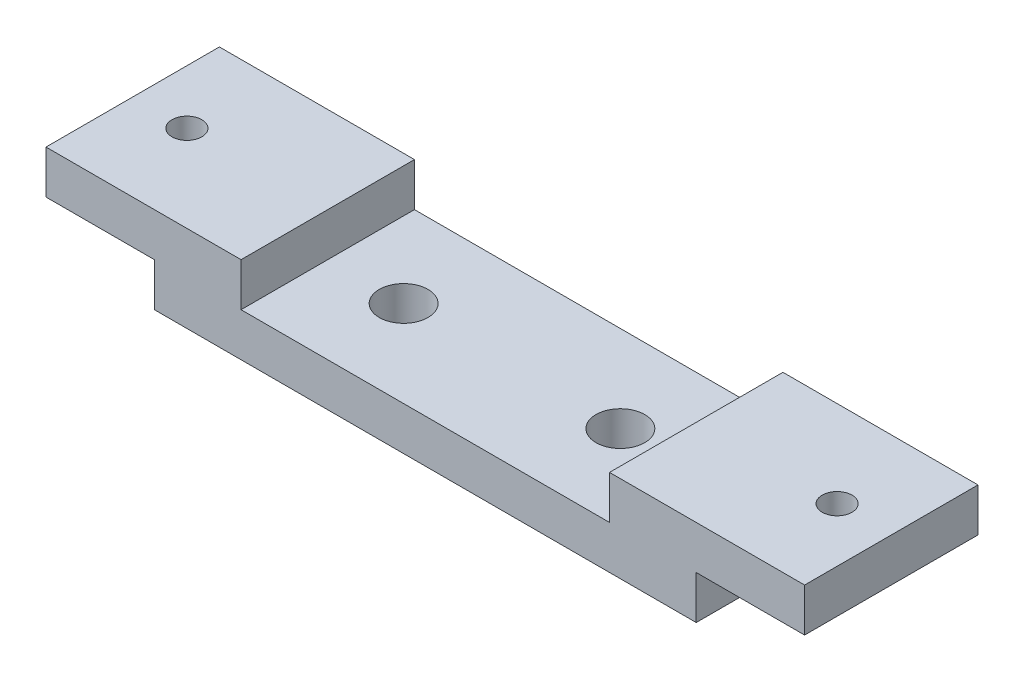
ISO-10303-21;
HEADER;
FILE_DESCRIPTION(('STEP AP214'),'2;1');
FILE_NAME('part.step','',(''),(''),'','','');
FILE_SCHEMA(('AUTOMOTIVE_DESIGN { 1 0 10303 214 1 1 1 1 }'));
ENDSEC;
DATA;
#1=APPLICATION_CONTEXT('core data for automotive mechanical design processes');
#2=APPLICATION_PROTOCOL_DEFINITION('international standard','automotive_design',2000,#1);
#3=PRODUCT_CONTEXT('',#1,'mechanical');
#4=PRODUCT('Part','Part','',(#3));
#5=PRODUCT_RELATED_PRODUCT_CATEGORY('part','',(#4));
#6=PRODUCT_DEFINITION_FORMATION('','',#4);
#7=PRODUCT_DEFINITION_CONTEXT('part definition',#1,'design');
#8=PRODUCT_DEFINITION('design','',#6,#7);
#9=PRODUCT_DEFINITION_SHAPE('','',#8);
#10=(LENGTH_UNIT() NAMED_UNIT(*) SI_UNIT(.MILLI.,.METRE.));
#11=(NAMED_UNIT(*) PLANE_ANGLE_UNIT() SI_UNIT($,.RADIAN.));
#12=(NAMED_UNIT(*) SI_UNIT($,.STERADIAN.) SOLID_ANGLE_UNIT());
#13=UNCERTAINTY_MEASURE_WITH_UNIT(LENGTH_MEASURE(1.E-05),#10,'distance_accuracy_value','');
#14=(GEOMETRIC_REPRESENTATION_CONTEXT(3) GLOBAL_UNCERTAINTY_ASSIGNED_CONTEXT((#13)) GLOBAL_UNIT_ASSIGNED_CONTEXT((#10,
#11,#12)) REPRESENTATION_CONTEXT('',''));
#15=CARTESIAN_POINT('',(0.,0.,0.));
#16=DIRECTION('',(0.,0.,1.));
#17=DIRECTION('',(1.,0.,0.));
#18=AXIS2_PLACEMENT_3D('',#15,#16,#17);
#19=CARTESIAN_POINT('',(-70.,8.,32.));
#20=DIRECTION('',(1.,0.,0.));
#21=DIRECTION('',(0.,0.,-1.));
#22=AXIS2_PLACEMENT_3D('',#19,#20,#21);
#23=PLANE('',#22);
#24=DIRECTION('',(0.,-1.,0.));
#25=VECTOR('',#24,1.);
#26=CARTESIAN_POINT('',(-70.,8.,0.));
#27=LINE('',#26,#25);
#28=CARTESIAN_POINT('',(-70.,16.,0.));
#29=VERTEX_POINT('',#28);
#30=CARTESIAN_POINT('',(-70.,8.,0.));
#31=VERTEX_POINT('',#30);
#32=EDGE_CURVE('E164',#29,#31,#27,.T.);
#33=ORIENTED_EDGE('',*,*,#32,.T.);
#34=DIRECTION('',(0.,0.,-1.));
#35=VECTOR('',#34,1.);
#36=CARTESIAN_POINT('',(-70.,8.,32.));
#37=LINE('',#36,#35);
#38=CARTESIAN_POINT('',(-70.,8.,32.));
#39=VERTEX_POINT('',#38);
#40=EDGE_CURVE('E11',#39,#31,#37,.T.);
#41=ORIENTED_EDGE('',*,*,#40,.F.);
#42=DIRECTION('',(0.,-1.,0.));
#43=VECTOR('',#42,1.);
#44=CARTESIAN_POINT('',(-70.,8.,32.));
#45=LINE('',#44,#43);
#46=CARTESIAN_POINT('',(-70.,16.,32.));
#47=VERTEX_POINT('',#46);
#48=EDGE_CURVE('E199',#47,#39,#45,.T.);
#49=ORIENTED_EDGE('',*,*,#48,.F.);
#50=DIRECTION('',(0.,0.,-1.));
#51=VECTOR('',#50,1.);
#52=CARTESIAN_POINT('',(-70.,16.,32.));
#53=LINE('',#52,#51);
#54=EDGE_CURVE('E160',#47,#29,#53,.T.);
#55=ORIENTED_EDGE('',*,*,#54,.T.);
#56=EDGE_LOOP('',(#33,#41,#49,#55));
#57=FACE_BOUND('',#56,.T.);
#58=ADVANCED_FACE('F39',(#57),#23,.F.);
#59=CARTESIAN_POINT('',(-50.,8.,32.));
#60=DIRECTION('',(0.,1.,0.));
#61=DIRECTION('',(-1.,0.,0.));
#62=AXIS2_PLACEMENT_3D('',#59,#60,#61);
#63=PLANE('',#62);
#64=CARTESIAN_POINT('',(-60.,8.,16.));
#65=DIRECTION('',(0.,-1.,0.));
#66=DIRECTION('',(0.,0.,-1.));
#67=AXIS2_PLACEMENT_3D('',#64,#65,#66);
#68=CIRCLE('',#67,2.75);
#69=CARTESIAN_POINT('',(-60.,8.,13.25));
#70=VERTEX_POINT('',#69);
#71=EDGE_CURVE('E364',#70,#70,#68,.T.);
#72=ORIENTED_EDGE('',*,*,#71,.F.);
#73=EDGE_LOOP('',(#72));
#74=FACE_BOUND('',#73,.T.);
#75=DIRECTION('',(1.,0.,0.));
#76=VECTOR('',#75,1.);
#77=CARTESIAN_POINT('',(-50.,8.,0.));
#78=LINE('',#77,#76);
#79=CARTESIAN_POINT('',(-50.,8.,0.));
#80=VERTEX_POINT('',#79);
#81=EDGE_CURVE('E168',#31,#80,#78,.T.);
#82=ORIENTED_EDGE('',*,*,#81,.T.);
#83=DIRECTION('',(0.,0.,-1.));
#84=VECTOR('',#83,1.);
#85=CARTESIAN_POINT('',(-50.,8.,32.));
#86=LINE('',#85,#84);
#87=CARTESIAN_POINT('',(-50.,8.,32.));
#88=VERTEX_POINT('',#87);
#89=EDGE_CURVE('E48',#88,#80,#86,.T.);
#90=ORIENTED_EDGE('',*,*,#89,.F.);
#91=DIRECTION('',(1.,0.,0.));
#92=VECTOR('',#91,1.);
#93=CARTESIAN_POINT('',(-50.,8.,32.));
#94=LINE('',#93,#92);
#95=EDGE_CURVE('E111',#39,#88,#94,.T.);
#96=ORIENTED_EDGE('',*,*,#95,.F.);
#97=ORIENTED_EDGE('',*,*,#40,.T.);
#98=EDGE_LOOP('',(#82,#90,#96,#97));
#99=FACE_BOUND('',#98,.T.);
#100=ADVANCED_FACE('F295',(#74,#99),#63,.F.);
#101=CARTESIAN_POINT('',(-50.,8.,32.));
#102=DIRECTION('',(1.,0.,0.));
#103=DIRECTION('',(0.,0.,-1.));
#104=AXIS2_PLACEMENT_3D('',#101,#102,#103);
#105=PLANE('',#104);
#106=DIRECTION('',(0.,-1.,0.));
#107=VECTOR('',#106,1.);
#108=CARTESIAN_POINT('',(-50.,8.,0.));
#109=LINE('',#108,#107);
#110=CARTESIAN_POINT('',(-50.,0.,0.));
#111=VERTEX_POINT('',#110);
#112=EDGE_CURVE('E172',#80,#111,#109,.T.);
#113=ORIENTED_EDGE('',*,*,#112,.T.);
#114=DIRECTION('',(0.,0.,-1.));
#115=VECTOR('',#114,1.);
#116=CARTESIAN_POINT('',(-50.,0.,32.));
#117=LINE('',#116,#115);
#118=CARTESIAN_POINT('',(-50.,0.,32.));
#119=VERTEX_POINT('',#118);
#120=EDGE_CURVE('E226',#119,#111,#117,.T.);
#121=ORIENTED_EDGE('',*,*,#120,.F.);
#122=DIRECTION('',(0.,-1.,0.));
#123=VECTOR('',#122,1.);
#124=CARTESIAN_POINT('',(-50.,8.,32.));
#125=LINE('',#124,#123);
#126=EDGE_CURVE('E236',#88,#119,#125,.T.);
#127=ORIENTED_EDGE('',*,*,#126,.F.);
#128=ORIENTED_EDGE('',*,*,#89,.T.);
#129=EDGE_LOOP('',(#113,#121,#127,#128));
#130=FACE_BOUND('',#129,.T.);
#131=ADVANCED_FACE('F234',(#130),#105,.F.);
#132=CARTESIAN_POINT('',(-50.,0.,32.));
#133=DIRECTION('',(0.,1.,0.));
#134=DIRECTION('',(-1.,0.,0.));
#135=AXIS2_PLACEMENT_3D('',#132,#133,#134);
#136=PLANE('',#135);
#137=CARTESIAN_POINT('',(20.,0.,16.));
#138=DIRECTION('',(0.,1.,0.));
#139=DIRECTION('',(0.,0.,1.));
#140=AXIS2_PLACEMENT_3D('',#137,#138,#139);
#141=CIRCLE('',#140,4.5);
#142=CARTESIAN_POINT('',(20.,0.,20.5));
#143=VERTEX_POINT('',#142);
#144=EDGE_CURVE('E337',#143,#143,#141,.T.);
#145=ORIENTED_EDGE('',*,*,#144,.T.);
#146=EDGE_LOOP('',(#145));
#147=FACE_BOUND('',#146,.T.);
#148=CARTESIAN_POINT('',(-20.,0.,16.));
#149=DIRECTION('',(0.,1.,0.));
#150=DIRECTION('',(0.,0.,1.));
#151=AXIS2_PLACEMENT_3D('',#148,#149,#150);
#152=CIRCLE('',#151,4.5);
#153=CARTESIAN_POINT('',(-20.,0.,20.5));
#154=VERTEX_POINT('',#153);
#155=EDGE_CURVE('E169',#154,#154,#152,.T.);
#156=ORIENTED_EDGE('',*,*,#155,.T.);
#157=EDGE_LOOP('',(#156));
#158=FACE_BOUND('',#157,.T.);
#159=DIRECTION('',(1.,0.,0.));
#160=VECTOR('',#159,1.);
#161=CARTESIAN_POINT('',(-50.,0.,0.));
#162=LINE('',#161,#160);
#163=CARTESIAN_POINT('',(50.,0.,0.));
#164=VERTEX_POINT('',#163);
#165=EDGE_CURVE('E175',#111,#164,#162,.T.);
#166=ORIENTED_EDGE('',*,*,#165,.T.);
#167=DIRECTION('',(0.,0.,-1.));
#168=VECTOR('',#167,1.);
#169=CARTESIAN_POINT('',(50.,0.,32.));
#170=LINE('',#169,#168);
#171=CARTESIAN_POINT('',(50.,0.,32.));
#172=VERTEX_POINT('',#171);
#173=EDGE_CURVE('E222',#172,#164,#170,.T.);
#174=ORIENTED_EDGE('',*,*,#173,.F.);
#175=DIRECTION('',(1.,0.,0.));
#176=VECTOR('',#175,1.);
#177=CARTESIAN_POINT('',(-50.,0.,32.));
#178=LINE('',#177,#176);
#179=EDGE_CURVE('E255',#119,#172,#178,.T.);
#180=ORIENTED_EDGE('',*,*,#179,.F.);
#181=ORIENTED_EDGE('',*,*,#120,.T.);
#182=EDGE_LOOP('',(#166,#174,#180,#181));
#183=FACE_BOUND('',#182,.T.);
#184=ADVANCED_FACE('F245',(#147,#158,#183),#136,.F.);
#185=CARTESIAN_POINT('',(50.,0.,32.));
#186=DIRECTION('',(-1.,0.,0.));
#187=DIRECTION('',(0.,0.,1.));
#188=AXIS2_PLACEMENT_3D('',#185,#186,#187);
#189=PLANE('',#188);
#190=DIRECTION('',(0.,1.,0.));
#191=VECTOR('',#190,1.);
#192=CARTESIAN_POINT('',(50.,0.,0.));
#193=LINE('',#192,#191);
#194=CARTESIAN_POINT('',(50.,8.00000000000002,0.));
#195=VERTEX_POINT('',#194);
#196=EDGE_CURVE('E178',#164,#195,#193,.T.);
#197=ORIENTED_EDGE('',*,*,#196,.T.);
#198=DIRECTION('',(0.,0.,-1.));
#199=VECTOR('',#198,1.);
#200=CARTESIAN_POINT('',(50.,8.00000000000002,32.));
#201=LINE('',#200,#199);
#202=CARTESIAN_POINT('',(50.,8.00000000000002,32.));
#203=VERTEX_POINT('',#202);
#204=EDGE_CURVE('E218',#203,#195,#201,.T.);
#205=ORIENTED_EDGE('',*,*,#204,.F.);
#206=DIRECTION('',(0.,1.,0.));
#207=VECTOR('',#206,1.);
#208=CARTESIAN_POINT('',(50.,0.,32.));
#209=LINE('',#208,#207);
#210=EDGE_CURVE('E251',#172,#203,#209,.T.);
#211=ORIENTED_EDGE('',*,*,#210,.F.);
#212=ORIENTED_EDGE('',*,*,#173,.T.);
#213=EDGE_LOOP('',(#197,#205,#211,#212));
#214=FACE_BOUND('',#213,.T.);
#215=ADVANCED_FACE('F249',(#214),#189,.F.);
#216=CARTESIAN_POINT('',(70.,8.,32.));
#217=DIRECTION('',(0.,1.,0.));
#218=DIRECTION('',(-1.,0.,0.));
#219=AXIS2_PLACEMENT_3D('',#216,#217,#218);
#220=PLANE('',#219);
#221=CARTESIAN_POINT('',(60.,8.00000000000001,16.));
#222=DIRECTION('',(0.,-1.,0.));
#223=DIRECTION('',(0.,0.,-1.));
#224=AXIS2_PLACEMENT_3D('',#221,#222,#223);
#225=CIRCLE('',#224,2.75);
#226=CARTESIAN_POINT('',(60.,8.00000000000001,13.25));
#227=VERTEX_POINT('',#226);
#228=EDGE_CURVE('E357',#227,#227,#225,.T.);
#229=ORIENTED_EDGE('',*,*,#228,.F.);
#230=EDGE_LOOP('',(#229));
#231=FACE_BOUND('',#230,.T.);
#232=DIRECTION('',(1.,0.,0.));
#233=VECTOR('',#232,1.);
#234=CARTESIAN_POINT('',(70.,8.,0.));
#235=LINE('',#234,#233);
#236=CARTESIAN_POINT('',(70.,8.,0.));
#237=VERTEX_POINT('',#236);
#238=EDGE_CURVE('E181',#195,#237,#235,.T.);
#239=ORIENTED_EDGE('',*,*,#238,.T.);
#240=DIRECTION('',(0.,0.,-1.));
#241=VECTOR('',#240,1.);
#242=CARTESIAN_POINT('',(70.,8.,32.));
#243=LINE('',#242,#241);
#244=CARTESIAN_POINT('',(70.,8.,32.));
#245=VERTEX_POINT('',#244);
#246=EDGE_CURVE('E214',#245,#237,#243,.T.);
#247=ORIENTED_EDGE('',*,*,#246,.F.);
#248=DIRECTION('',(1.,0.,0.));
#249=VECTOR('',#248,1.);
#250=CARTESIAN_POINT('',(70.,8.,32.));
#251=LINE('',#250,#249);
#252=EDGE_CURVE('E254',#203,#245,#251,.T.);
#253=ORIENTED_EDGE('',*,*,#252,.F.);
#254=ORIENTED_EDGE('',*,*,#204,.T.);
#255=EDGE_LOOP('',(#239,#247,#253,#254));
#256=FACE_BOUND('',#255,.T.);
#257=ADVANCED_FACE('F311',(#231,#256),#220,.F.);
#258=CARTESIAN_POINT('',(70.,16.,32.));
#259=DIRECTION('',(-1.,0.,0.));
#260=DIRECTION('',(0.,0.,1.));
#261=AXIS2_PLACEMENT_3D('',#258,#259,#260);
#262=PLANE('',#261);
#263=DIRECTION('',(0.,1.,0.));
#264=VECTOR('',#263,1.);
#265=CARTESIAN_POINT('',(70.,16.,0.));
#266=LINE('',#265,#264);
#267=CARTESIAN_POINT('',(70.,16.,0.));
#268=VERTEX_POINT('',#267);
#269=EDGE_CURVE('E184',#237,#268,#266,.T.);
#270=ORIENTED_EDGE('',*,*,#269,.T.);
#271=DIRECTION('',(0.,0.,-1.));
#272=VECTOR('',#271,1.);
#273=CARTESIAN_POINT('',(70.,16.,32.));
#274=LINE('',#273,#272);
#275=CARTESIAN_POINT('',(70.,16.,32.));
#276=VERTEX_POINT('',#275);
#277=EDGE_CURVE('E210',#276,#268,#274,.T.);
#278=ORIENTED_EDGE('',*,*,#277,.F.);
#279=DIRECTION('',(0.,1.,0.));
#280=VECTOR('',#279,1.);
#281=CARTESIAN_POINT('',(70.,16.,32.));
#282=LINE('',#281,#280);
#283=EDGE_CURVE('E259',#245,#276,#282,.T.);
#284=ORIENTED_EDGE('',*,*,#283,.F.);
#285=ORIENTED_EDGE('',*,*,#246,.T.);
#286=EDGE_LOOP('',(#270,#278,#284,#285));
#287=FACE_BOUND('',#286,.T.);
#288=ADVANCED_FACE('F314',(#287),#262,.F.);
#289=CARTESIAN_POINT('',(34.,16.,32.));
#290=DIRECTION('',(0.,-1.,0.));
#291=DIRECTION('',(0.,0.,-1.));
#292=AXIS2_PLACEMENT_3D('',#289,#290,#291);
#293=PLANE('',#292);
#294=CARTESIAN_POINT('',(60.,16.,16.));
#295=DIRECTION('',(0.,-1.,0.));
#296=DIRECTION('',(0.,0.,-1.));
#297=AXIS2_PLACEMENT_3D('',#294,#295,#296);
#298=CIRCLE('',#297,2.75);
#299=CARTESIAN_POINT('',(60.,16.,13.25));
#300=VERTEX_POINT('',#299);
#301=EDGE_CURVE('E353',#300,#300,#298,.T.);
#302=ORIENTED_EDGE('',*,*,#301,.T.);
#303=EDGE_LOOP('',(#302));
#304=FACE_BOUND('',#303,.T.);
#305=DIRECTION('',(-1.,0.,0.));
#306=VECTOR('',#305,1.);
#307=CARTESIAN_POINT('',(34.,16.,0.));
#308=LINE('',#307,#306);
#309=CARTESIAN_POINT('',(34.,16.,0.));
#310=VERTEX_POINT('',#309);
#311=EDGE_CURVE('E187',#268,#310,#308,.T.);
#312=ORIENTED_EDGE('',*,*,#311,.T.);
#313=DIRECTION('',(0.,0.,-1.));
#314=VECTOR('',#313,1.);
#315=CARTESIAN_POINT('',(34.,16.,32.));
#316=LINE('',#315,#314);
#317=CARTESIAN_POINT('',(34.,16.,32.));
#318=VERTEX_POINT('',#317);
#319=EDGE_CURVE('E206',#318,#310,#316,.T.);
#320=ORIENTED_EDGE('',*,*,#319,.F.);
#321=DIRECTION('',(-1.,0.,0.));
#322=VECTOR('',#321,1.);
#323=CARTESIAN_POINT('',(34.,16.,32.));
#324=LINE('',#323,#322);
#325=EDGE_CURVE('E266',#276,#318,#324,.T.);
#326=ORIENTED_EDGE('',*,*,#325,.F.);
#327=ORIENTED_EDGE('',*,*,#277,.T.);
#328=EDGE_LOOP('',(#312,#320,#326,#327));
#329=FACE_BOUND('',#328,.T.);
#330=ADVANCED_FACE('F274',(#304,#329),#293,.F.);
#331=CARTESIAN_POINT('',(34.,8.,32.));
#332=DIRECTION('',(1.,0.,0.));
#333=DIRECTION('',(0.,0.,-1.));
#334=AXIS2_PLACEMENT_3D('',#331,#332,#333);
#335=PLANE('',#334);
#336=DIRECTION('',(0.,-1.,0.));
#337=VECTOR('',#336,1.);
#338=CARTESIAN_POINT('',(34.,8.,0.));
#339=LINE('',#338,#337);
#340=CARTESIAN_POINT('',(34.,8.,0.));
#341=VERTEX_POINT('',#340);
#342=EDGE_CURVE('E190',#310,#341,#339,.T.);
#343=ORIENTED_EDGE('',*,*,#342,.T.);
#344=DIRECTION('',(0.,0.,-1.));
#345=VECTOR('',#344,1.);
#346=CARTESIAN_POINT('',(34.,8.,32.));
#347=LINE('',#346,#345);
#348=CARTESIAN_POINT('',(34.,8.,32.));
#349=VERTEX_POINT('',#348);
#350=EDGE_CURVE('E153',#349,#341,#347,.T.);
#351=ORIENTED_EDGE('',*,*,#350,.F.);
#352=DIRECTION('',(0.,-1.,0.));
#353=VECTOR('',#352,1.);
#354=CARTESIAN_POINT('',(34.,8.,32.));
#355=LINE('',#354,#353);
#356=EDGE_CURVE('E142',#318,#349,#355,.T.);
#357=ORIENTED_EDGE('',*,*,#356,.F.);
#358=ORIENTED_EDGE('',*,*,#319,.T.);
#359=EDGE_LOOP('',(#343,#351,#357,#358));
#360=FACE_BOUND('',#359,.T.);
#361=ADVANCED_FACE('F278',(#360),#335,.F.);
#362=CARTESIAN_POINT('',(-34.,8.,32.));
#363=DIRECTION('',(0.,-1.,0.));
#364=DIRECTION('',(0.,0.,-1.));
#365=AXIS2_PLACEMENT_3D('',#362,#363,#364);
#366=PLANE('',#365);
#367=CARTESIAN_POINT('',(20.,8.,16.));
#368=DIRECTION('',(0.,1.,0.));
#369=DIRECTION('',(0.,0.,1.));
#370=AXIS2_PLACEMENT_3D('',#367,#368,#369);
#371=CIRCLE('',#370,4.5);
#372=CARTESIAN_POINT('',(20.,8.,20.5));
#373=VERTEX_POINT('',#372);
#374=EDGE_CURVE('E331',#373,#373,#371,.T.);
#375=ORIENTED_EDGE('',*,*,#374,.F.);
#376=EDGE_LOOP('',(#375));
#377=FACE_BOUND('',#376,.T.);
#378=CARTESIAN_POINT('',(-20.,8.,16.));
#379=DIRECTION('',(0.,1.,0.));
#380=DIRECTION('',(0.,0.,1.));
#381=AXIS2_PLACEMENT_3D('',#378,#379,#380);
#382=CIRCLE('',#381,4.5);
#383=CARTESIAN_POINT('',(-20.,8.,20.5));
#384=VERTEX_POINT('',#383);
#385=EDGE_CURVE('E334',#384,#384,#382,.T.);
#386=ORIENTED_EDGE('',*,*,#385,.F.);
#387=EDGE_LOOP('',(#386));
#388=FACE_BOUND('',#387,.T.);
#389=DIRECTION('',(-1.,0.,0.));
#390=VECTOR('',#389,1.);
#391=CARTESIAN_POINT('',(-34.,8.,0.));
#392=LINE('',#391,#390);
#393=CARTESIAN_POINT('',(-34.,8.,0.));
#394=VERTEX_POINT('',#393);
#395=EDGE_CURVE('E151',#341,#394,#392,.T.);
#396=ORIENTED_EDGE('',*,*,#395,.T.);
#397=DIRECTION('',(0.,0.,-1.));
#398=VECTOR('',#397,1.);
#399=CARTESIAN_POINT('',(-34.,8.,32.));
#400=LINE('',#399,#398);
#401=CARTESIAN_POINT('',(-34.,8.,32.));
#402=VERTEX_POINT('',#401);
#403=EDGE_CURVE('E148',#402,#394,#400,.T.);
#404=ORIENTED_EDGE('',*,*,#403,.F.);
#405=DIRECTION('',(-1.,0.,0.));
#406=VECTOR('',#405,1.);
#407=CARTESIAN_POINT('',(-34.,8.,32.));
#408=LINE('',#407,#406);
#409=EDGE_CURVE('E136',#349,#402,#408,.T.);
#410=ORIENTED_EDGE('',*,*,#409,.F.);
#411=ORIENTED_EDGE('',*,*,#350,.T.);
#412=EDGE_LOOP('',(#396,#404,#410,#411));
#413=FACE_BOUND('',#412,.T.);
#414=ADVANCED_FACE('F149',(#377,#388,#413),#366,.F.);
#415=CARTESIAN_POINT('',(-34.,16.,32.));
#416=DIRECTION('',(-1.,0.,0.));
#417=DIRECTION('',(0.,0.,1.));
#418=AXIS2_PLACEMENT_3D('',#415,#416,#417);
#419=PLANE('',#418);
#420=DIRECTION('',(0.,1.,0.));
#421=VECTOR('',#420,1.);
#422=CARTESIAN_POINT('',(-34.,16.,0.));
#423=LINE('',#422,#421);
#424=CARTESIAN_POINT('',(-34.,16.,0.));
#425=VERTEX_POINT('',#424);
#426=EDGE_CURVE('E97',#394,#425,#423,.T.);
#427=ORIENTED_EDGE('',*,*,#426,.T.);
#428=DIRECTION('',(0.,0.,-1.));
#429=VECTOR('',#428,1.);
#430=CARTESIAN_POINT('',(-34.,16.,32.));
#431=LINE('',#430,#429);
#432=CARTESIAN_POINT('',(-34.,16.,32.));
#433=VERTEX_POINT('',#432);
#434=EDGE_CURVE('E154',#433,#425,#431,.T.);
#435=ORIENTED_EDGE('',*,*,#434,.F.);
#436=DIRECTION('',(0.,1.,0.));
#437=VECTOR('',#436,1.);
#438=CARTESIAN_POINT('',(-34.,16.,32.));
#439=LINE('',#438,#437);
#440=EDGE_CURVE('E140',#402,#433,#439,.T.);
#441=ORIENTED_EDGE('',*,*,#440,.F.);
#442=ORIENTED_EDGE('',*,*,#403,.T.);
#443=EDGE_LOOP('',(#427,#435,#441,#442));
#444=FACE_BOUND('',#443,.T.);
#445=ADVANCED_FACE('F156',(#444),#419,.F.);
#446=CARTESIAN_POINT('',(-70.,16.,32.));
#447=DIRECTION('',(0.,-1.,0.));
#448=DIRECTION('',(0.,0.,-1.));
#449=AXIS2_PLACEMENT_3D('',#446,#447,#448);
#450=PLANE('',#449);
#451=CARTESIAN_POINT('',(-60.,16.,16.));
#452=DIRECTION('',(0.,-1.,0.));
#453=DIRECTION('',(0.,0.,-1.));
#454=AXIS2_PLACEMENT_3D('',#451,#452,#453);
#455=CIRCLE('',#454,2.75);
#456=CARTESIAN_POINT('',(-60.,16.,13.25));
#457=VERTEX_POINT('',#456);
#458=EDGE_CURVE('E361',#457,#457,#455,.T.);
#459=ORIENTED_EDGE('',*,*,#458,.T.);
#460=EDGE_LOOP('',(#459));
#461=FACE_BOUND('',#460,.T.);
#462=DIRECTION('',(-1.,0.,0.));
#463=VECTOR('',#462,1.);
#464=CARTESIAN_POINT('',(-70.,16.,0.));
#465=LINE('',#464,#463);
#466=EDGE_CURVE('E103',#425,#29,#465,.T.);
#467=ORIENTED_EDGE('',*,*,#466,.T.);
#468=ORIENTED_EDGE('',*,*,#54,.F.);
#469=DIRECTION('',(-1.,0.,0.));
#470=VECTOR('',#469,1.);
#471=CARTESIAN_POINT('',(-70.,16.,32.));
#472=LINE('',#471,#470);
#473=EDGE_CURVE('E56',#433,#47,#472,.T.);
#474=ORIENTED_EDGE('',*,*,#473,.F.);
#475=ORIENTED_EDGE('',*,*,#434,.T.);
#476=EDGE_LOOP('',(#467,#468,#474,#475));
#477=FACE_BOUND('',#476,.T.);
#478=ADVANCED_FACE('F282',(#461,#477),#450,.F.);
#479=CARTESIAN_POINT('',(0.,0.,32.));
#480=DIRECTION('',(0.,0.,-1.));
#481=DIRECTION('',(-1.,0.,0.));
#482=AXIS2_PLACEMENT_3D('',#479,#480,#481);
#483=PLANE('',#482);
#484=ORIENTED_EDGE('',*,*,#48,.T.);
#485=ORIENTED_EDGE('',*,*,#95,.T.);
#486=ORIENTED_EDGE('',*,*,#126,.T.);
#487=ORIENTED_EDGE('',*,*,#179,.T.);
#488=ORIENTED_EDGE('',*,*,#210,.T.);
#489=ORIENTED_EDGE('',*,*,#252,.T.);
#490=ORIENTED_EDGE('',*,*,#283,.T.);
#491=ORIENTED_EDGE('',*,*,#325,.T.);
#492=ORIENTED_EDGE('',*,*,#356,.T.);
#493=ORIENTED_EDGE('',*,*,#409,.T.);
#494=ORIENTED_EDGE('',*,*,#440,.T.);
#495=ORIENTED_EDGE('',*,*,#473,.T.);
#496=EDGE_LOOP('',(#484,#485,#486,#487,#488,#489,#490,#491,#492,#493,#494,#495));
#497=FACE_BOUND('',#496,.T.);
#498=ADVANCED_FACE('F138',(#497),#483,.F.);
#499=CARTESIAN_POINT('',(0.,0.,0.));
#500=DIRECTION('',(0.,0.,-1.));
#501=DIRECTION('',(-1.,0.,0.));
#502=AXIS2_PLACEMENT_3D('',#499,#500,#501);
#503=PLANE('',#502);
#504=ORIENTED_EDGE('',*,*,#32,.F.);
#505=ORIENTED_EDGE('',*,*,#466,.F.);
#506=ORIENTED_EDGE('',*,*,#426,.F.);
#507=ORIENTED_EDGE('',*,*,#395,.F.);
#508=ORIENTED_EDGE('',*,*,#342,.F.);
#509=ORIENTED_EDGE('',*,*,#311,.F.);
#510=ORIENTED_EDGE('',*,*,#269,.F.);
#511=ORIENTED_EDGE('',*,*,#238,.F.);
#512=ORIENTED_EDGE('',*,*,#196,.F.);
#513=ORIENTED_EDGE('',*,*,#165,.F.);
#514=ORIENTED_EDGE('',*,*,#112,.F.);
#515=ORIENTED_EDGE('',*,*,#81,.F.);
#516=EDGE_LOOP('',(#504,#505,#506,#507,#508,#509,#510,#511,#512,#513,#514,#515));
#517=FACE_BOUND('',#516,.T.);
#518=ADVANCED_FACE('F240',(#517),#503,.T.);
#519=CARTESIAN_POINT('',(-20.,8.,16.));
#520=DIRECTION('',(0.,1.,0.));
#521=DIRECTION('',(0.,0.,1.));
#522=AXIS2_PLACEMENT_3D('',#519,#520,#521);
#523=CYLINDRICAL_SURFACE('',#522,4.5);
#524=ORIENTED_EDGE('',*,*,#155,.F.);
#525=EDGE_LOOP('',(#524));
#526=FACE_BOUND('',#525,.T.);
#527=ORIENTED_EDGE('',*,*,#385,.T.);
#528=EDGE_LOOP('',(#527));
#529=FACE_BOUND('',#528,.T.);
#530=ADVANCED_FACE('F383',(#526,#529),#523,.F.);
#531=CARTESIAN_POINT('',(20.,8.,16.));
#532=DIRECTION('',(0.,1.,0.));
#533=DIRECTION('',(0.,0.,1.));
#534=AXIS2_PLACEMENT_3D('',#531,#532,#533);
#535=CYLINDRICAL_SURFACE('',#534,4.5);
#536=ORIENTED_EDGE('',*,*,#144,.F.);
#537=EDGE_LOOP('',(#536));
#538=FACE_BOUND('',#537,.T.);
#539=ORIENTED_EDGE('',*,*,#374,.T.);
#540=EDGE_LOOP('',(#539));
#541=FACE_BOUND('',#540,.T.);
#542=ADVANCED_FACE('F376',(#538,#541),#535,.F.);
#543=CARTESIAN_POINT('',(60.,8.00000000000001,16.));
#544=DIRECTION('',(0.,-1.,0.));
#545=DIRECTION('',(0.,0.,-1.));
#546=AXIS2_PLACEMENT_3D('',#543,#544,#545);
#547=CYLINDRICAL_SURFACE('',#546,2.75);
#548=ORIENTED_EDGE('',*,*,#301,.F.);
#549=EDGE_LOOP('',(#548));
#550=FACE_BOUND('',#549,.T.);
#551=ORIENTED_EDGE('',*,*,#228,.T.);
#552=EDGE_LOOP('',(#551));
#553=FACE_BOUND('',#552,.T.);
#554=ADVANCED_FACE('F370',(#550,#553),#547,.F.);
#555=CARTESIAN_POINT('',(-60.,8.,16.));
#556=DIRECTION('',(0.,-1.,0.));
#557=DIRECTION('',(0.,0.,-1.));
#558=AXIS2_PLACEMENT_3D('',#555,#556,#557);
#559=CYLINDRICAL_SURFACE('',#558,2.75);
#560=ORIENTED_EDGE('',*,*,#458,.F.);
#561=EDGE_LOOP('',(#560));
#562=FACE_BOUND('',#561,.T.);
#563=ORIENTED_EDGE('',*,*,#71,.T.);
#564=EDGE_LOOP('',(#563));
#565=FACE_BOUND('',#564,.T.);
#566=ADVANCED_FACE('F368',(#562,#565),#559,.F.);
#567=CLOSED_SHELL('',(#58,#100,#131,#184,#215,#257,#288,#330,#361,#414,#445,#478,#498,#518,#530,
#542,#554,#566));
#568=MANIFOLD_SOLID_BREP('B2',#567);
#569=ADVANCED_BREP_SHAPE_REPRESENTATION('',(#18,#568),#14);
#570=SHAPE_DEFINITION_REPRESENTATION(#9,#569);
ENDSEC;
END-ISO-10303-21;
